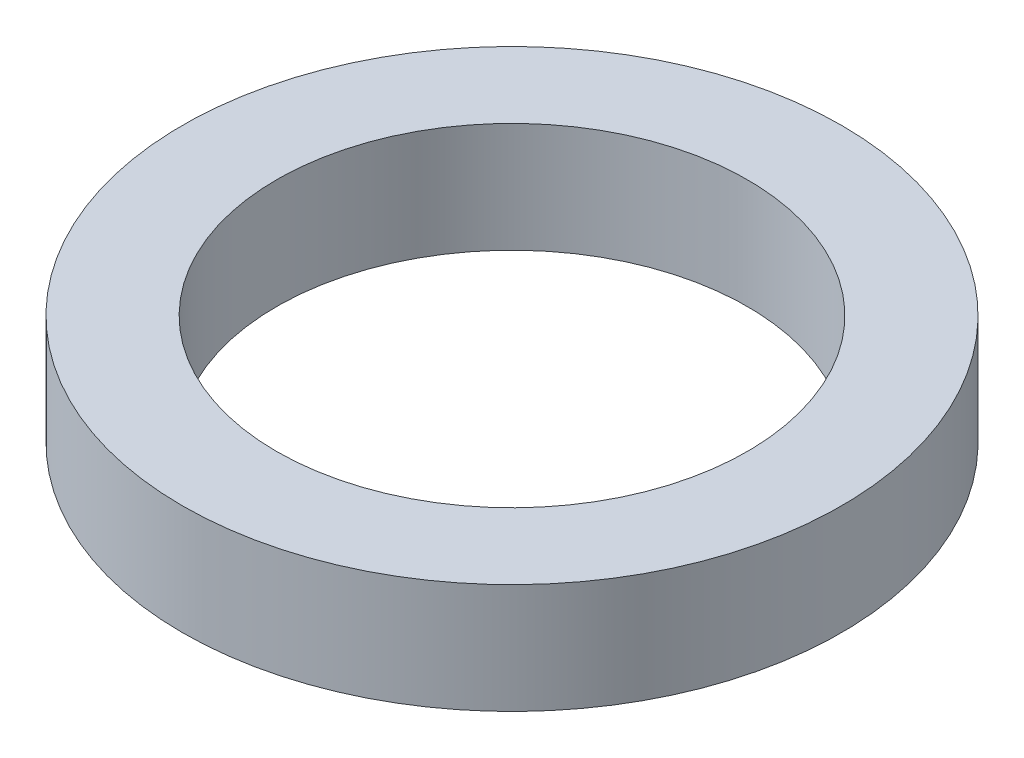
ISO-10303-21;
HEADER;
FILE_DESCRIPTION(('STEP AP214'),'2;1');
FILE_NAME('part.step','',(''),(''),'','','');
FILE_SCHEMA(('AUTOMOTIVE_DESIGN { 1 0 10303 214 1 1 1 1 }'));
ENDSEC;
DATA;
#1=APPLICATION_CONTEXT('core data for automotive mechanical design processes');
#2=APPLICATION_PROTOCOL_DEFINITION('international standard','automotive_design',2000,#1);
#3=PRODUCT_CONTEXT('',#1,'mechanical');
#4=PRODUCT('Part','Part','',(#3));
#5=PRODUCT_RELATED_PRODUCT_CATEGORY('part','',(#4));
#6=PRODUCT_DEFINITION_FORMATION('','',#4);
#7=PRODUCT_DEFINITION_CONTEXT('part definition',#1,'design');
#8=PRODUCT_DEFINITION('design','',#6,#7);
#9=PRODUCT_DEFINITION_SHAPE('','',#8);
#10=(LENGTH_UNIT() NAMED_UNIT(*) SI_UNIT(.MILLI.,.METRE.));
#11=(NAMED_UNIT(*) PLANE_ANGLE_UNIT() SI_UNIT($,.RADIAN.));
#12=(NAMED_UNIT(*) SI_UNIT($,.STERADIAN.) SOLID_ANGLE_UNIT());
#13=UNCERTAINTY_MEASURE_WITH_UNIT(LENGTH_MEASURE(1.E-05),#10,'distance_accuracy_value','');
#14=(GEOMETRIC_REPRESENTATION_CONTEXT(3) GLOBAL_UNCERTAINTY_ASSIGNED_CONTEXT((#13)) GLOBAL_UNIT_ASSIGNED_CONTEXT((#10,
#11,#12)) REPRESENTATION_CONTEXT('',''));
#15=CARTESIAN_POINT('',(0.,0.,0.));
#16=DIRECTION('',(0.,0.,1.));
#17=DIRECTION('',(1.,0.,0.));
#18=AXIS2_PLACEMENT_3D('',#15,#16,#17);
#19=CARTESIAN_POINT('',(0.,7.,0.));
#20=DIRECTION('',(0.,1.,0.));
#21=DIRECTION('',(0.,0.,1.));
#22=AXIS2_PLACEMENT_3D('',#19,#20,#21);
#23=PLANE('',#22);
#24=CARTESIAN_POINT('',(0.,7.,0.));
#25=DIRECTION('',(0.,1.,0.));
#26=DIRECTION('',(0.,0.,1.));
#27=AXIS2_PLACEMENT_3D('',#24,#25,#26);
#28=CIRCLE('',#27,21.);
#29=CARTESIAN_POINT('',(0.,7.,21.));
#30=VERTEX_POINT('',#29);
#31=EDGE_CURVE('E10',#30,#30,#28,.T.);
#32=ORIENTED_EDGE('',*,*,#31,.T.);
#33=EDGE_LOOP('',(#32));
#34=FACE_BOUND('',#33,.T.);
#35=CARTESIAN_POINT('',(0.,7.,0.));
#36=DIRECTION('',(0.,1.,0.));
#37=DIRECTION('',(0.,0.,1.));
#38=AXIS2_PLACEMENT_3D('',#35,#36,#37);
#39=CIRCLE('',#38,15.);
#40=CARTESIAN_POINT('',(0.,7.,15.));
#41=VERTEX_POINT('',#40);
#42=EDGE_CURVE('E45',#41,#41,#39,.T.);
#43=ORIENTED_EDGE('',*,*,#42,.F.);
#44=EDGE_LOOP('',(#43));
#45=FACE_BOUND('',#44,.T.);
#46=ADVANCED_FACE('F34',(#34,#45),#23,.T.);
#47=CARTESIAN_POINT('',(0.,0.,0.));
#48=DIRECTION('',(0.,1.,0.));
#49=DIRECTION('',(0.,0.,1.));
#50=AXIS2_PLACEMENT_3D('',#47,#48,#49);
#51=PLANE('',#50);
#52=CARTESIAN_POINT('',(0.,0.,0.));
#53=DIRECTION('',(0.,1.,0.));
#54=DIRECTION('',(0.,0.,1.));
#55=AXIS2_PLACEMENT_3D('',#52,#53,#54);
#56=CIRCLE('',#55,21.);
#57=CARTESIAN_POINT('',(0.,0.,21.));
#58=VERTEX_POINT('',#57);
#59=EDGE_CURVE('E38',#58,#58,#56,.T.);
#60=ORIENTED_EDGE('',*,*,#59,.F.);
#61=EDGE_LOOP('',(#60));
#62=FACE_BOUND('',#61,.T.);
#63=CARTESIAN_POINT('',(0.,0.,0.));
#64=DIRECTION('',(0.,1.,0.));
#65=DIRECTION('',(0.,0.,1.));
#66=AXIS2_PLACEMENT_3D('',#63,#64,#65);
#67=CIRCLE('',#66,15.);
#68=CARTESIAN_POINT('',(0.,0.,15.));
#69=VERTEX_POINT('',#68);
#70=EDGE_CURVE('E47',#69,#69,#67,.T.);
#71=ORIENTED_EDGE('',*,*,#70,.T.);
#72=EDGE_LOOP('',(#71));
#73=FACE_BOUND('',#72,.T.);
#74=ADVANCED_FACE('F57',(#62,#73),#51,.F.);
#75=CARTESIAN_POINT('',(0.,7.,0.));
#76=DIRECTION('',(0.,-1.,0.));
#77=DIRECTION('',(0.,0.,-1.));
#78=AXIS2_PLACEMENT_3D('',#75,#76,#77);
#79=CYLINDRICAL_SURFACE('',#78,21.);
#80=ORIENTED_EDGE('',*,*,#31,.F.);
#81=EDGE_LOOP('',(#80));
#82=FACE_BOUND('',#81,.T.);
#83=ORIENTED_EDGE('',*,*,#59,.T.);
#84=EDGE_LOOP('',(#83));
#85=FACE_BOUND('',#84,.T.);
#86=ADVANCED_FACE('F36',(#82,#85),#79,.T.);
#87=CARTESIAN_POINT('',(0.,7.,0.));
#88=DIRECTION('',(0.,-1.,0.));
#89=DIRECTION('',(0.,0.,-1.));
#90=AXIS2_PLACEMENT_3D('',#87,#88,#89);
#91=CYLINDRICAL_SURFACE('',#90,15.);
#92=ORIENTED_EDGE('',*,*,#42,.T.);
#93=EDGE_LOOP('',(#92));
#94=FACE_BOUND('',#93,.T.);
#95=ORIENTED_EDGE('',*,*,#70,.F.);
#96=EDGE_LOOP('',(#95));
#97=FACE_BOUND('',#96,.T.);
#98=ADVANCED_FACE('F53',(#94,#97),#91,.F.);
#99=CLOSED_SHELL('',(#46,#74,#86,#98));
#100=MANIFOLD_SOLID_BREP('B2',#99);
#101=ADVANCED_BREP_SHAPE_REPRESENTATION('',(#18,#100),#14);
#102=SHAPE_DEFINITION_REPRESENTATION(#9,#101);
ENDSEC;
END-ISO-10303-21;
